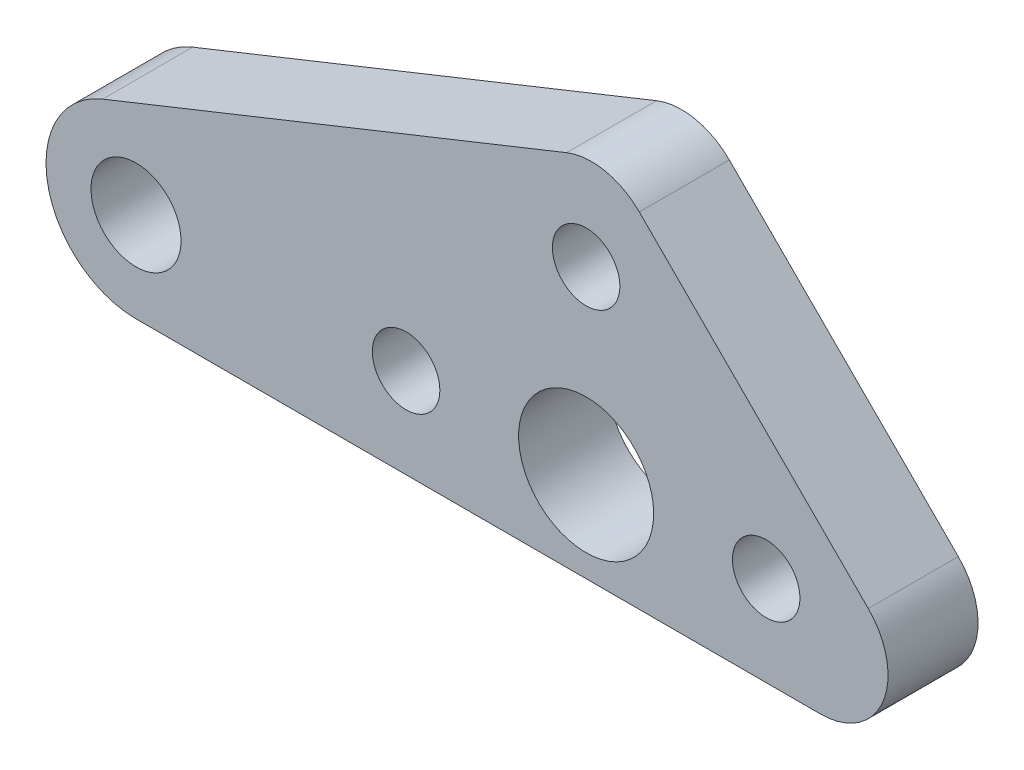
ISO-10303-21;
HEADER;
FILE_DESCRIPTION(('STEP AP214'),'2;1');
FILE_NAME('part.step','',(''),(''),'','','');
FILE_SCHEMA(('AUTOMOTIVE_DESIGN { 1 0 10303 214 1 1 1 1 }'));
ENDSEC;
DATA;
#1=APPLICATION_CONTEXT('core data for automotive mechanical design processes');
#2=APPLICATION_PROTOCOL_DEFINITION('international standard','automotive_design',2000,#1);
#3=PRODUCT_CONTEXT('',#1,'mechanical');
#4=PRODUCT('Part','Part','',(#3));
#5=PRODUCT_RELATED_PRODUCT_CATEGORY('part','',(#4));
#6=PRODUCT_DEFINITION_FORMATION('','',#4);
#7=PRODUCT_DEFINITION_CONTEXT('part definition',#1,'design');
#8=PRODUCT_DEFINITION('design','',#6,#7);
#9=PRODUCT_DEFINITION_SHAPE('','',#8);
#10=(LENGTH_UNIT() NAMED_UNIT(*) SI_UNIT(.MILLI.,.METRE.));
#11=(NAMED_UNIT(*) PLANE_ANGLE_UNIT() SI_UNIT($,.RADIAN.));
#12=(NAMED_UNIT(*) SI_UNIT($,.STERADIAN.) SOLID_ANGLE_UNIT());
#13=UNCERTAINTY_MEASURE_WITH_UNIT(LENGTH_MEASURE(1.E-05),#10,'distance_accuracy_value','');
#14=(GEOMETRIC_REPRESENTATION_CONTEXT(3) GLOBAL_UNCERTAINTY_ASSIGNED_CONTEXT((#13)) GLOBAL_UNIT_ASSIGNED_CONTEXT((#10,
#11,#12)) REPRESENTATION_CONTEXT('',''));
#15=CARTESIAN_POINT('',(0.,0.,0.));
#16=DIRECTION('',(0.,0.,1.));
#17=DIRECTION('',(1.,0.,0.));
#18=AXIS2_PLACEMENT_3D('',#15,#16,#17);
#19=CARTESIAN_POINT('',(10.4142135623731,-1.,-4.));
#20=DIRECTION('',(0.,0.,-1.));
#21=DIRECTION('',(1.,0.,0.));
#22=AXIS2_PLACEMENT_3D('',#19,#20,#21);
#23=PLANE('',#22);
#24=CARTESIAN_POINT('',(0.,0.,-4.));
#25=DIRECTION('',(0.,0.,1.));
#26=DIRECTION('',(1.,0.,0.));
#27=AXIS2_PLACEMENT_3D('',#24,#25,#26);
#28=CIRCLE('',#27,3.);
#29=CARTESIAN_POINT('',(3.,0.,-4.));
#30=VERTEX_POINT('',#29);
#31=EDGE_CURVE('E166',#30,#30,#28,.T.);
#32=ORIENTED_EDGE('',*,*,#31,.T.);
#33=EDGE_LOOP('',(#32));
#34=FACE_BOUND('',#33,.T.);
#35=CARTESIAN_POINT('',(8.,0.,-4.));
#36=DIRECTION('',(0.,0.,1.));
#37=DIRECTION('',(1.,0.,0.));
#38=AXIS2_PLACEMENT_3D('',#35,#36,#37);
#39=CIRCLE('',#38,1.5);
#40=CARTESIAN_POINT('',(9.5,0.,-4.));
#41=VERTEX_POINT('',#40);
#42=EDGE_CURVE('E154',#41,#41,#39,.T.);
#43=ORIENTED_EDGE('',*,*,#42,.T.);
#44=EDGE_LOOP('',(#43));
#45=FACE_BOUND('',#44,.T.);
#46=CARTESIAN_POINT('',(10.4142135623731,-1.,-4.));
#47=DIRECTION('',(0.,0.,1.));
#48=DIRECTION('',(1.,0.,0.));
#49=AXIS2_PLACEMENT_3D('',#46,#47,#48);
#50=CIRCLE('',#49,3.);
#51=CARTESIAN_POINT('',(10.4142135623731,-4.,-4.));
#52=VERTEX_POINT('',#51);
#53=CARTESIAN_POINT('',(12.5355339059327,1.12132034355964,-4.));
#54=VERTEX_POINT('',#53);
#55=EDGE_CURVE('E137',#52,#54,#50,.T.);
#56=ORIENTED_EDGE('',*,*,#55,.F.);
#57=DIRECTION('',(1.,0.,0.));
#58=VECTOR('',#57,1.);
#59=CARTESIAN_POINT('',(-20.,-4.,-4.));
#60=LINE('',#59,#58);
#61=CARTESIAN_POINT('',(-20.,-4.,-4.));
#62=VERTEX_POINT('',#61);
#63=EDGE_CURVE('E117',#62,#52,#60,.T.);
#64=ORIENTED_EDGE('',*,*,#63,.F.);
#65=CARTESIAN_POINT('',(-20.,0.,-4.));
#66=DIRECTION('',(0.,0.,1.));
#67=DIRECTION('',(1.,0.,0.));
#68=AXIS2_PLACEMENT_3D('',#65,#66,#67);
#69=CIRCLE('',#68,4.);
#70=CARTESIAN_POINT('',(-21.4855627054164,3.71390676354104,-4.));
#71=VERTEX_POINT('',#70);
#72=EDGE_CURVE('E98',#71,#62,#69,.T.);
#73=ORIENTED_EDGE('',*,*,#72,.F.);
#74=DIRECTION('',(-0.928476690885259,-0.371390676354104,0.));
#75=VECTOR('',#74,1.);
#76=CARTESIAN_POINT('',(-0.873328742672173,11.9588003486387,-4.));
#77=LINE('',#76,#75);
#78=CARTESIAN_POINT('',(-0.873328742672173,11.9588003486387,-4.));
#79=VERTEX_POINT('',#78);
#80=EDGE_CURVE('E108',#79,#71,#77,.T.);
#81=ORIENTED_EDGE('',*,*,#80,.F.);
#82=CARTESIAN_POINT('',(0.240843286390138,9.17337027598296,-4.));
#83=DIRECTION('',(0.,0.,1.));
#84=DIRECTION('',(-1.,0.,0.));
#85=AXIS2_PLACEMENT_3D('',#82,#83,#84);
#86=CIRCLE('',#85,3.);
#87=CARTESIAN_POINT('',(2.36216362994978,11.2946906195426,-4.));
#88=VERTEX_POINT('',#87);
#89=EDGE_CURVE('E113',#88,#79,#86,.T.);
#90=ORIENTED_EDGE('',*,*,#89,.F.);
#91=DIRECTION('',(-0.707106781186548,0.707106781186547,0.));
#92=VECTOR('',#91,1.);
#93=CARTESIAN_POINT('',(12.5355339059327,1.12132034355964,-4.));
#94=LINE('',#93,#92);
#95=EDGE_CURVE('E142',#54,#88,#94,.T.);
#96=ORIENTED_EDGE('',*,*,#95,.F.);
#97=EDGE_LOOP('',(#56,#64,#73,#81,#90,#96));
#98=FACE_BOUND('',#97,.T.);
#99=CARTESIAN_POINT('',(0.,8.,-4.));
#100=DIRECTION('',(0.,0.,1.));
#101=DIRECTION('',(1.,0.,0.));
#102=AXIS2_PLACEMENT_3D('',#99,#100,#101);
#103=CIRCLE('',#102,1.5);
#104=CARTESIAN_POINT('',(1.5,8.,-4.));
#105=VERTEX_POINT('',#104);
#106=EDGE_CURVE('E126',#105,#105,#103,.T.);
#107=ORIENTED_EDGE('',*,*,#106,.T.);
#108=EDGE_LOOP('',(#107));
#109=FACE_BOUND('',#108,.T.);
#110=CARTESIAN_POINT('',(-20.,0.,-4.));
#111=DIRECTION('',(0.,0.,1.));
#112=DIRECTION('',(1.,0.,0.));
#113=AXIS2_PLACEMENT_3D('',#110,#111,#112);
#114=CIRCLE('',#113,2.);
#115=CARTESIAN_POINT('',(-18.,0.,-4.));
#116=VERTEX_POINT('',#115);
#117=EDGE_CURVE('E160',#116,#116,#114,.T.);
#118=ORIENTED_EDGE('',*,*,#117,.T.);
#119=EDGE_LOOP('',(#118));
#120=FACE_BOUND('',#119,.T.);
#121=CARTESIAN_POINT('',(-8.,0.,-4.));
#122=DIRECTION('',(0.,0.,1.));
#123=DIRECTION('',(1.,0.,0.));
#124=AXIS2_PLACEMENT_3D('',#121,#122,#123);
#125=CIRCLE('',#124,1.5);
#126=CARTESIAN_POINT('',(-6.5,0.,-4.));
#127=VERTEX_POINT('',#126);
#128=EDGE_CURVE('E172',#127,#127,#125,.T.);
#129=ORIENTED_EDGE('',*,*,#128,.T.);
#130=EDGE_LOOP('',(#129));
#131=FACE_BOUND('',#130,.T.);
#132=ADVANCED_FACE('F37',(#34,#45,#98,#109,#120,#131),#23,.T.);
#133=CARTESIAN_POINT('',(10.4142135623731,-1.,0.));
#134=DIRECTION('',(0.,0.,-1.));
#135=DIRECTION('',(1.,0.,0.));
#136=AXIS2_PLACEMENT_3D('',#133,#134,#135);
#137=PLANE('',#136);
#138=CARTESIAN_POINT('',(10.4142135623731,-1.,0.));
#139=DIRECTION('',(0.,0.,1.));
#140=DIRECTION('',(1.,0.,0.));
#141=AXIS2_PLACEMENT_3D('',#138,#139,#140);
#142=CIRCLE('',#141,3.);
#143=CARTESIAN_POINT('',(10.4142135623731,-4.,0.));
#144=VERTEX_POINT('',#143);
#145=CARTESIAN_POINT('',(12.5355339059327,1.12132034355964,0.));
#146=VERTEX_POINT('',#145);
#147=EDGE_CURVE('E122',#144,#146,#142,.T.);
#148=ORIENTED_EDGE('',*,*,#147,.T.);
#149=DIRECTION('',(-0.707106781186548,0.707106781186547,0.));
#150=VECTOR('',#149,1.);
#151=CARTESIAN_POINT('',(12.5355339059327,1.12132034355964,0.));
#152=LINE('',#151,#150);
#153=CARTESIAN_POINT('',(2.36216362994978,11.2946906195426,0.));
#154=VERTEX_POINT('',#153);
#155=EDGE_CURVE('E125',#146,#154,#152,.T.);
#156=ORIENTED_EDGE('',*,*,#155,.T.);
#157=CARTESIAN_POINT('',(0.240843286390138,9.17337027598296,0.));
#158=DIRECTION('',(0.,0.,1.));
#159=DIRECTION('',(-1.,0.,0.));
#160=AXIS2_PLACEMENT_3D('',#157,#158,#159);
#161=CIRCLE('',#160,3.);
#162=CARTESIAN_POINT('',(-0.873328742672173,11.9588003486387,0.));
#163=VERTEX_POINT('',#162);
#164=EDGE_CURVE('E129',#154,#163,#161,.T.);
#165=ORIENTED_EDGE('',*,*,#164,.T.);
#166=DIRECTION('',(-0.928476690885259,-0.371390676354104,0.));
#167=VECTOR('',#166,1.);
#168=CARTESIAN_POINT('',(-0.873328742672173,11.9588003486387,0.));
#169=LINE('',#168,#167);
#170=CARTESIAN_POINT('',(-21.4855627054164,3.71390676354104,0.));
#171=VERTEX_POINT('',#170);
#172=EDGE_CURVE('E132',#163,#171,#169,.T.);
#173=ORIENTED_EDGE('',*,*,#172,.T.);
#174=CARTESIAN_POINT('',(-20.,0.,0.));
#175=DIRECTION('',(0.,0.,1.));
#176=DIRECTION('',(1.,0.,0.));
#177=AXIS2_PLACEMENT_3D('',#174,#175,#176);
#178=CIRCLE('',#177,4.);
#179=CARTESIAN_POINT('',(-20.,-4.,0.));
#180=VERTEX_POINT('',#179);
#181=EDGE_CURVE('E101',#171,#180,#178,.T.);
#182=ORIENTED_EDGE('',*,*,#181,.T.);
#183=DIRECTION('',(1.,0.,0.));
#184=VECTOR('',#183,1.);
#185=CARTESIAN_POINT('',(-20.,-4.,0.));
#186=LINE('',#185,#184);
#187=EDGE_CURVE('E135',#180,#144,#186,.T.);
#188=ORIENTED_EDGE('',*,*,#187,.T.);
#189=EDGE_LOOP('',(#148,#156,#165,#173,#182,#188));
#190=FACE_BOUND('',#189,.T.);
#191=CARTESIAN_POINT('',(0.,8.,0.));
#192=DIRECTION('',(0.,0.,1.));
#193=DIRECTION('',(1.,0.,0.));
#194=AXIS2_PLACEMENT_3D('',#191,#192,#193);
#195=CIRCLE('',#194,1.5);
#196=CARTESIAN_POINT('',(1.5,8.,0.));
#197=VERTEX_POINT('',#196);
#198=EDGE_CURVE('E151',#197,#197,#195,.T.);
#199=ORIENTED_EDGE('',*,*,#198,.F.);
#200=EDGE_LOOP('',(#199));
#201=FACE_BOUND('',#200,.T.);
#202=CARTESIAN_POINT('',(8.,0.,0.));
#203=DIRECTION('',(0.,0.,1.));
#204=DIRECTION('',(1.,0.,0.));
#205=AXIS2_PLACEMENT_3D('',#202,#203,#204);
#206=CIRCLE('',#205,1.5);
#207=CARTESIAN_POINT('',(9.5,0.,0.));
#208=VERTEX_POINT('',#207);
#209=EDGE_CURVE('E157',#208,#208,#206,.T.);
#210=ORIENTED_EDGE('',*,*,#209,.F.);
#211=EDGE_LOOP('',(#210));
#212=FACE_BOUND('',#211,.T.);
#213=CARTESIAN_POINT('',(-20.,0.,0.));
#214=DIRECTION('',(0.,0.,1.));
#215=DIRECTION('',(1.,0.,0.));
#216=AXIS2_PLACEMENT_3D('',#213,#214,#215);
#217=CIRCLE('',#216,2.);
#218=CARTESIAN_POINT('',(-18.,0.,0.));
#219=VERTEX_POINT('',#218);
#220=EDGE_CURVE('E163',#219,#219,#217,.T.);
#221=ORIENTED_EDGE('',*,*,#220,.F.);
#222=EDGE_LOOP('',(#221));
#223=FACE_BOUND('',#222,.T.);
#224=CARTESIAN_POINT('',(0.,0.,0.));
#225=DIRECTION('',(0.,0.,1.));
#226=DIRECTION('',(1.,0.,0.));
#227=AXIS2_PLACEMENT_3D('',#224,#225,#226);
#228=CIRCLE('',#227,3.);
#229=CARTESIAN_POINT('',(3.,0.,0.));
#230=VERTEX_POINT('',#229);
#231=EDGE_CURVE('E169',#230,#230,#228,.T.);
#232=ORIENTED_EDGE('',*,*,#231,.F.);
#233=EDGE_LOOP('',(#232));
#234=FACE_BOUND('',#233,.T.);
#235=CARTESIAN_POINT('',(-8.,0.,0.));
#236=DIRECTION('',(0.,0.,1.));
#237=DIRECTION('',(1.,0.,0.));
#238=AXIS2_PLACEMENT_3D('',#235,#236,#237);
#239=CIRCLE('',#238,1.5);
#240=CARTESIAN_POINT('',(-6.5,0.,0.));
#241=VERTEX_POINT('',#240);
#242=EDGE_CURVE('E175',#241,#241,#239,.T.);
#243=ORIENTED_EDGE('',*,*,#242,.F.);
#244=EDGE_LOOP('',(#243));
#245=FACE_BOUND('',#244,.T.);
#246=ADVANCED_FACE('F146',(#190,#201,#212,#223,#234,#245),#137,.F.);
#247=CARTESIAN_POINT('',(10.4142135623731,-1.,-4.));
#248=DIRECTION('',(0.,0.,1.));
#249=DIRECTION('',(-1.,0.,0.));
#250=AXIS2_PLACEMENT_3D('',#247,#248,#249);
#251=CYLINDRICAL_SURFACE('',#250,3.);
#252=ORIENTED_EDGE('',*,*,#147,.F.);
#253=DIRECTION('',(0.,0.,1.));
#254=VECTOR('',#253,1.);
#255=CARTESIAN_POINT('',(10.4142135623731,-4.,-4.));
#256=LINE('',#255,#254);
#257=EDGE_CURVE('E54',#52,#144,#256,.T.);
#258=ORIENTED_EDGE('',*,*,#257,.F.);
#259=ORIENTED_EDGE('',*,*,#55,.T.);
#260=DIRECTION('',(0.,0.,1.));
#261=VECTOR('',#260,1.);
#262=CARTESIAN_POINT('',(12.5355339059327,1.12132034355964,-4.));
#263=LINE('',#262,#261);
#264=EDGE_CURVE('E11',#54,#146,#263,.T.);
#265=ORIENTED_EDGE('',*,*,#264,.T.);
#266=EDGE_LOOP('',(#252,#258,#259,#265));
#267=FACE_BOUND('',#266,.T.);
#268=ADVANCED_FACE('F39',(#267),#251,.T.);
#269=CARTESIAN_POINT('',(12.5355339059327,1.12132034355964,-4.));
#270=DIRECTION('',(-0.707106781186547,-0.707106781186548,0.));
#271=DIRECTION('',(0.707106781186548,-0.707106781186547,0.));
#272=AXIS2_PLACEMENT_3D('',#269,#270,#271);
#273=PLANE('',#272);
#274=ORIENTED_EDGE('',*,*,#155,.F.);
#275=ORIENTED_EDGE('',*,*,#264,.F.);
#276=ORIENTED_EDGE('',*,*,#95,.T.);
#277=DIRECTION('',(0.,0.,1.));
#278=VECTOR('',#277,1.);
#279=CARTESIAN_POINT('',(2.36216362994978,11.2946906195426,-4.));
#280=LINE('',#279,#278);
#281=EDGE_CURVE('E46',#88,#154,#280,.T.);
#282=ORIENTED_EDGE('',*,*,#281,.T.);
#283=EDGE_LOOP('',(#274,#275,#276,#282));
#284=FACE_BOUND('',#283,.T.);
#285=ADVANCED_FACE('F141',(#284),#273,.F.);
#286=CARTESIAN_POINT('',(0.240843286390138,9.17337027598296,-4.));
#287=DIRECTION('',(0.,0.,1.));
#288=DIRECTION('',(-1.,0.,0.));
#289=AXIS2_PLACEMENT_3D('',#286,#287,#288);
#290=CYLINDRICAL_SURFACE('',#289,3.);
#291=ORIENTED_EDGE('',*,*,#164,.F.);
#292=ORIENTED_EDGE('',*,*,#281,.F.);
#293=ORIENTED_EDGE('',*,*,#89,.T.);
#294=DIRECTION('',(0.,0.,1.));
#295=VECTOR('',#294,1.);
#296=CARTESIAN_POINT('',(-0.873328742672173,11.9588003486387,-4.));
#297=LINE('',#296,#295);
#298=EDGE_CURVE('E105',#79,#163,#297,.T.);
#299=ORIENTED_EDGE('',*,*,#298,.T.);
#300=EDGE_LOOP('',(#291,#292,#293,#299));
#301=FACE_BOUND('',#300,.T.);
#302=ADVANCED_FACE('F144',(#301),#290,.T.);
#303=CARTESIAN_POINT('',(-0.873328742672173,11.9588003486387,-4.));
#304=DIRECTION('',(0.371390676354104,-0.928476690885259,0.));
#305=DIRECTION('',(0.92847669088526,0.371390676354104,0.));
#306=AXIS2_PLACEMENT_3D('',#303,#304,#305);
#307=PLANE('',#306);
#308=ORIENTED_EDGE('',*,*,#172,.F.);
#309=ORIENTED_EDGE('',*,*,#298,.F.);
#310=ORIENTED_EDGE('',*,*,#80,.T.);
#311=DIRECTION('',(0.,0.,1.));
#312=VECTOR('',#311,1.);
#313=CARTESIAN_POINT('',(-21.4855627054164,3.71390676354104,-4.));
#314=LINE('',#313,#312);
#315=EDGE_CURVE('E94',#71,#171,#314,.T.);
#316=ORIENTED_EDGE('',*,*,#315,.T.);
#317=EDGE_LOOP('',(#308,#309,#310,#316));
#318=FACE_BOUND('',#317,.T.);
#319=ADVANCED_FACE('F109',(#318),#307,.F.);
#320=CARTESIAN_POINT('',(-20.,0.,-4.));
#321=DIRECTION('',(0.,0.,1.));
#322=DIRECTION('',(-1.,0.,0.));
#323=AXIS2_PLACEMENT_3D('',#320,#321,#322);
#324=CYLINDRICAL_SURFACE('',#323,4.);
#325=ORIENTED_EDGE('',*,*,#181,.F.);
#326=ORIENTED_EDGE('',*,*,#315,.F.);
#327=ORIENTED_EDGE('',*,*,#72,.T.);
#328=DIRECTION('',(0.,0.,1.));
#329=VECTOR('',#328,1.);
#330=CARTESIAN_POINT('',(-20.,-4.,-4.));
#331=LINE('',#330,#329);
#332=EDGE_CURVE('E76',#62,#180,#331,.T.);
#333=ORIENTED_EDGE('',*,*,#332,.T.);
#334=EDGE_LOOP('',(#325,#326,#327,#333));
#335=FACE_BOUND('',#334,.T.);
#336=ADVANCED_FACE('F96',(#335),#324,.T.);
#337=CARTESIAN_POINT('',(-20.,-4.,-4.));
#338=DIRECTION('',(0.,1.,0.));
#339=DIRECTION('',(-1.,0.,0.));
#340=AXIS2_PLACEMENT_3D('',#337,#338,#339);
#341=PLANE('',#340);
#342=ORIENTED_EDGE('',*,*,#187,.F.);
#343=ORIENTED_EDGE('',*,*,#332,.F.);
#344=ORIENTED_EDGE('',*,*,#63,.T.);
#345=ORIENTED_EDGE('',*,*,#257,.T.);
#346=EDGE_LOOP('',(#342,#343,#344,#345));
#347=FACE_BOUND('',#346,.T.);
#348=ADVANCED_FACE('F199',(#347),#341,.F.);
#349=CARTESIAN_POINT('',(0.,8.,-4.));
#350=DIRECTION('',(0.,0.,1.));
#351=DIRECTION('',(-1.,0.,0.));
#352=AXIS2_PLACEMENT_3D('',#349,#350,#351);
#353=CYLINDRICAL_SURFACE('',#352,1.5);
#354=ORIENTED_EDGE('',*,*,#106,.F.);
#355=EDGE_LOOP('',(#354));
#356=FACE_BOUND('',#355,.T.);
#357=ORIENTED_EDGE('',*,*,#198,.T.);
#358=EDGE_LOOP('',(#357));
#359=FACE_BOUND('',#358,.T.);
#360=ADVANCED_FACE('F202',(#356,#359),#353,.F.);
#361=CARTESIAN_POINT('',(8.,0.,-4.));
#362=DIRECTION('',(0.,0.,1.));
#363=DIRECTION('',(-1.,0.,0.));
#364=AXIS2_PLACEMENT_3D('',#361,#362,#363);
#365=CYLINDRICAL_SURFACE('',#364,1.5);
#366=ORIENTED_EDGE('',*,*,#42,.F.);
#367=EDGE_LOOP('',(#366));
#368=FACE_BOUND('',#367,.T.);
#369=ORIENTED_EDGE('',*,*,#209,.T.);
#370=EDGE_LOOP('',(#369));
#371=FACE_BOUND('',#370,.T.);
#372=ADVANCED_FACE('F235',(#368,#371),#365,.F.);
#373=CARTESIAN_POINT('',(-20.,0.,-4.));
#374=DIRECTION('',(0.,0.,1.));
#375=DIRECTION('',(-1.,0.,0.));
#376=AXIS2_PLACEMENT_3D('',#373,#374,#375);
#377=CYLINDRICAL_SURFACE('',#376,2.);
#378=ORIENTED_EDGE('',*,*,#117,.F.);
#379=EDGE_LOOP('',(#378));
#380=FACE_BOUND('',#379,.T.);
#381=ORIENTED_EDGE('',*,*,#220,.T.);
#382=EDGE_LOOP('',(#381));
#383=FACE_BOUND('',#382,.T.);
#384=ADVANCED_FACE('F242',(#380,#383),#377,.F.);
#385=CARTESIAN_POINT('',(0.,0.,-4.));
#386=DIRECTION('',(0.,0.,1.));
#387=DIRECTION('',(-1.,0.,0.));
#388=AXIS2_PLACEMENT_3D('',#385,#386,#387);
#389=CYLINDRICAL_SURFACE('',#388,3.);
#390=ORIENTED_EDGE('',*,*,#31,.F.);
#391=EDGE_LOOP('',(#390));
#392=FACE_BOUND('',#391,.T.);
#393=ORIENTED_EDGE('',*,*,#231,.T.);
#394=EDGE_LOOP('',(#393));
#395=FACE_BOUND('',#394,.T.);
#396=ADVANCED_FACE('F185',(#392,#395),#389,.F.);
#397=CARTESIAN_POINT('',(-8.,0.,-4.));
#398=DIRECTION('',(0.,0.,1.));
#399=DIRECTION('',(-1.,0.,0.));
#400=AXIS2_PLACEMENT_3D('',#397,#398,#399);
#401=CYLINDRICAL_SURFACE('',#400,1.5);
#402=ORIENTED_EDGE('',*,*,#128,.F.);
#403=EDGE_LOOP('',(#402));
#404=FACE_BOUND('',#403,.T.);
#405=ORIENTED_EDGE('',*,*,#242,.T.);
#406=EDGE_LOOP('',(#405));
#407=FACE_BOUND('',#406,.T.);
#408=ADVANCED_FACE('F182',(#404,#407),#401,.F.);
#409=CLOSED_SHELL('',(#132,#246,#268,#285,#302,#319,#336,#348,#360,#372,#384,#396,#408));
#410=MANIFOLD_SOLID_BREP('B2',#409);
#411=ADVANCED_BREP_SHAPE_REPRESENTATION('',(#18,#410),#14);
#412=SHAPE_DEFINITION_REPRESENTATION(#9,#411);
ENDSEC;
END-ISO-10303-21;
